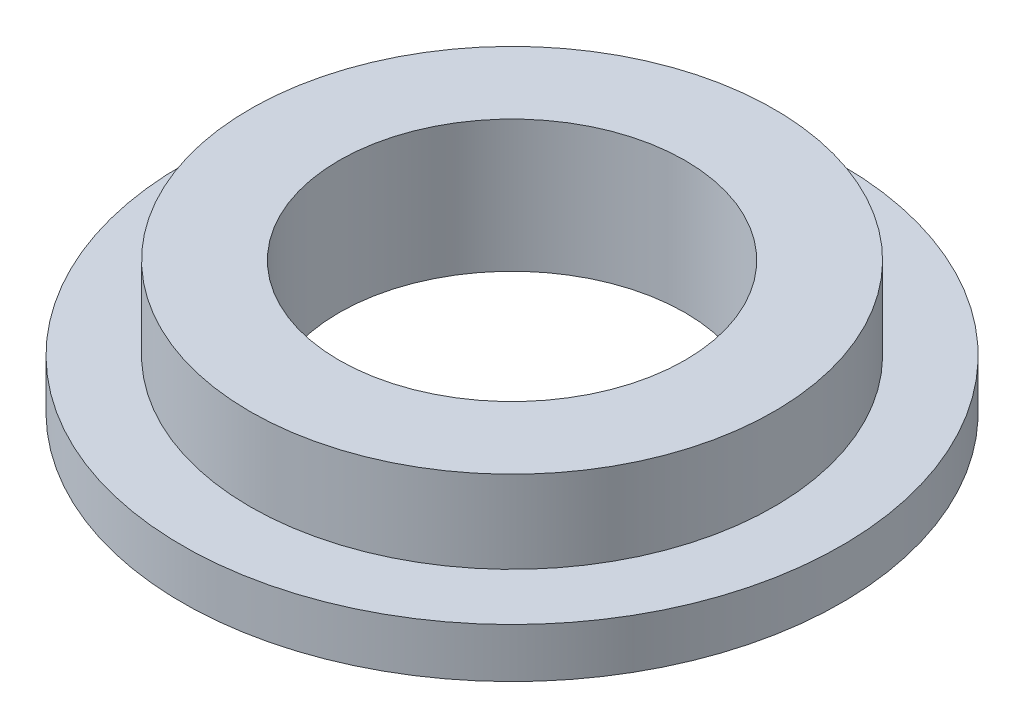
ISO-10303-21;
HEADER;
FILE_DESCRIPTION(('STEP AP214'),'2;1');
FILE_NAME('part.step','',(''),(''),'','','');
FILE_SCHEMA(('AUTOMOTIVE_DESIGN { 1 0 10303 214 1 1 1 1 }'));
ENDSEC;
DATA;
#1=APPLICATION_CONTEXT('core data for automotive mechanical design processes');
#2=APPLICATION_PROTOCOL_DEFINITION('international standard','automotive_design',2000,#1);
#3=PRODUCT_CONTEXT('',#1,'mechanical');
#4=PRODUCT('Part','Part','',(#3));
#5=PRODUCT_RELATED_PRODUCT_CATEGORY('part','',(#4));
#6=PRODUCT_DEFINITION_FORMATION('','',#4);
#7=PRODUCT_DEFINITION_CONTEXT('part definition',#1,'design');
#8=PRODUCT_DEFINITION('design','',#6,#7);
#9=PRODUCT_DEFINITION_SHAPE('','',#8);
#10=(LENGTH_UNIT() NAMED_UNIT(*) SI_UNIT(.MILLI.,.METRE.));
#11=(NAMED_UNIT(*) PLANE_ANGLE_UNIT() SI_UNIT($,.RADIAN.));
#12=(NAMED_UNIT(*) SI_UNIT($,.STERADIAN.) SOLID_ANGLE_UNIT());
#13=UNCERTAINTY_MEASURE_WITH_UNIT(LENGTH_MEASURE(1.E-05),#10,'distance_accuracy_value','');
#14=(GEOMETRIC_REPRESENTATION_CONTEXT(3) GLOBAL_UNCERTAINTY_ASSIGNED_CONTEXT((#13)) GLOBAL_UNIT_ASSIGNED_CONTEXT((#10,
#11,#12)) REPRESENTATION_CONTEXT('',''));
#15=CARTESIAN_POINT('',(0.,0.,0.));
#16=DIRECTION('',(0.,0.,1.));
#17=DIRECTION('',(1.,0.,0.));
#18=AXIS2_PLACEMENT_3D('',#15,#16,#17);
#19=CARTESIAN_POINT('',(0.,5.,0.));
#20=DIRECTION('',(0.,1.,0.));
#21=DIRECTION('',(0.,0.,1.));
#22=AXIS2_PLACEMENT_3D('',#19,#20,#21);
#23=PLANE('',#22);
#24=CARTESIAN_POINT('',(0.,5.,0.));
#25=DIRECTION('',(0.,1.,0.));
#26=DIRECTION('',(0.,0.,1.));
#27=AXIS2_PLACEMENT_3D('',#24,#25,#26);
#28=CIRCLE('',#27,15.9);
#29=CARTESIAN_POINT('',(0.,5.,15.9));
#30=VERTEX_POINT('',#29);
#31=EDGE_CURVE('E10',#30,#30,#28,.T.);
#32=ORIENTED_EDGE('',*,*,#31,.T.);
#33=EDGE_LOOP('',(#32));
#34=FACE_BOUND('',#33,.T.);
#35=CARTESIAN_POINT('',(0.,5.,0.));
#36=DIRECTION('',(0.,1.,0.));
#37=DIRECTION('',(0.,0.,1.));
#38=AXIS2_PLACEMENT_3D('',#35,#36,#37);
#39=CIRCLE('',#38,10.5);
#40=CARTESIAN_POINT('',(0.,5.,10.5));
#41=VERTEX_POINT('',#40);
#42=EDGE_CURVE('E47',#41,#41,#39,.T.);
#43=ORIENTED_EDGE('',*,*,#42,.F.);
#44=EDGE_LOOP('',(#43));
#45=FACE_BOUND('',#44,.T.);
#46=ADVANCED_FACE('F39',(#34,#45),#23,.T.);
#47=CARTESIAN_POINT('',(0.,5.,0.));
#48=DIRECTION('',(0.,-1.,0.));
#49=DIRECTION('',(0.,0.,-1.));
#50=AXIS2_PLACEMENT_3D('',#47,#48,#49);
#51=CYLINDRICAL_SURFACE('',#50,15.9);
#52=ORIENTED_EDGE('',*,*,#31,.F.);
#53=EDGE_LOOP('',(#52));
#54=FACE_BOUND('',#53,.T.);
#55=CARTESIAN_POINT('',(0.,0.,0.));
#56=DIRECTION('',(0.,1.,0.));
#57=DIRECTION('',(0.,0.,1.));
#58=AXIS2_PLACEMENT_3D('',#55,#56,#57);
#59=CIRCLE('',#58,15.9);
#60=CARTESIAN_POINT('',(0.,0.,15.9));
#61=VERTEX_POINT('',#60);
#62=EDGE_CURVE('E43',#61,#61,#59,.T.);
#63=ORIENTED_EDGE('',*,*,#62,.T.);
#64=EDGE_LOOP('',(#63));
#65=FACE_BOUND('',#64,.T.);
#66=ADVANCED_FACE('F41',(#54,#65),#51,.T.);
#67=CARTESIAN_POINT('',(0.,5.,0.));
#68=DIRECTION('',(0.,-1.,0.));
#69=DIRECTION('',(0.,0.,-1.));
#70=AXIS2_PLACEMENT_3D('',#67,#68,#69);
#71=CYLINDRICAL_SURFACE('',#70,10.5);
#72=ORIENTED_EDGE('',*,*,#42,.T.);
#73=EDGE_LOOP('',(#72));
#74=FACE_BOUND('',#73,.T.);
#75=CARTESIAN_POINT('',(0.,-3.,0.));
#76=DIRECTION('',(0.,-1.,0.));
#77=DIRECTION('',(0.,0.,-1.));
#78=AXIS2_PLACEMENT_3D('',#75,#76,#77);
#79=CIRCLE('',#78,10.5);
#80=CARTESIAN_POINT('',(0.,-3.,-10.5));
#81=VERTEX_POINT('',#80);
#82=EDGE_CURVE('E57',#81,#81,#79,.T.);
#83=ORIENTED_EDGE('',*,*,#82,.T.);
#84=EDGE_LOOP('',(#83));
#85=FACE_BOUND('',#84,.T.);
#86=ADVANCED_FACE('F63',(#74,#85),#71,.F.);
#87=CARTESIAN_POINT('',(0.,-3.,0.));
#88=DIRECTION('',(0.,-1.,0.));
#89=DIRECTION('',(0.,0.,-1.));
#90=AXIS2_PLACEMENT_3D('',#87,#88,#89);
#91=PLANE('',#90);
#92=CARTESIAN_POINT('',(0.,-3.,0.));
#93=DIRECTION('',(0.,-1.,0.));
#94=DIRECTION('',(0.,0.,-1.));
#95=AXIS2_PLACEMENT_3D('',#92,#93,#94);
#96=CIRCLE('',#95,20.);
#97=CARTESIAN_POINT('',(0.,-3.,-20.));
#98=VERTEX_POINT('',#97);
#99=EDGE_CURVE('E56',#98,#98,#96,.T.);
#100=ORIENTED_EDGE('',*,*,#99,.T.);
#101=EDGE_LOOP('',(#100));
#102=FACE_BOUND('',#101,.T.);
#103=ORIENTED_EDGE('',*,*,#82,.F.);
#104=EDGE_LOOP('',(#103));
#105=FACE_BOUND('',#104,.T.);
#106=ADVANCED_FACE('F65',(#102,#105),#91,.T.);
#107=CARTESIAN_POINT('',(0.,0.,0.));
#108=DIRECTION('',(0.,-1.,0.));
#109=DIRECTION('',(0.,0.,-1.));
#110=AXIS2_PLACEMENT_3D('',#107,#108,#109);
#111=PLANE('',#110);
#112=ORIENTED_EDGE('',*,*,#62,.F.);
#113=EDGE_LOOP('',(#112));
#114=FACE_BOUND('',#113,.T.);
#115=CARTESIAN_POINT('',(0.,0.,0.));
#116=DIRECTION('',(0.,-1.,0.));
#117=DIRECTION('',(0.,0.,-1.));
#118=AXIS2_PLACEMENT_3D('',#115,#116,#117);
#119=CIRCLE('',#118,20.);
#120=CARTESIAN_POINT('',(0.,0.,-20.));
#121=VERTEX_POINT('',#120);
#122=EDGE_CURVE('E53',#121,#121,#119,.T.);
#123=ORIENTED_EDGE('',*,*,#122,.F.);
#124=EDGE_LOOP('',(#123));
#125=FACE_BOUND('',#124,.T.);
#126=ADVANCED_FACE('F67',(#114,#125),#111,.F.);
#127=CARTESIAN_POINT('',(0.,-3.,0.));
#128=DIRECTION('',(0.,1.,0.));
#129=DIRECTION('',(0.,0.,1.));
#130=AXIS2_PLACEMENT_3D('',#127,#128,#129);
#131=CYLINDRICAL_SURFACE('',#130,20.);
#132=ORIENTED_EDGE('',*,*,#99,.F.);
#133=EDGE_LOOP('',(#132));
#134=FACE_BOUND('',#133,.T.);
#135=ORIENTED_EDGE('',*,*,#122,.T.);
#136=EDGE_LOOP('',(#135));
#137=FACE_BOUND('',#136,.T.);
#138=ADVANCED_FACE('F74',(#134,#137),#131,.T.);
#139=CLOSED_SHELL('',(#46,#66,#86,#106,#126,#138));
#140=MANIFOLD_SOLID_BREP('B2',#139);
#141=ADVANCED_BREP_SHAPE_REPRESENTATION('',(#18,#140),#14);
#142=SHAPE_DEFINITION_REPRESENTATION(#9,#141);
ENDSEC;
END-ISO-10303-21;
